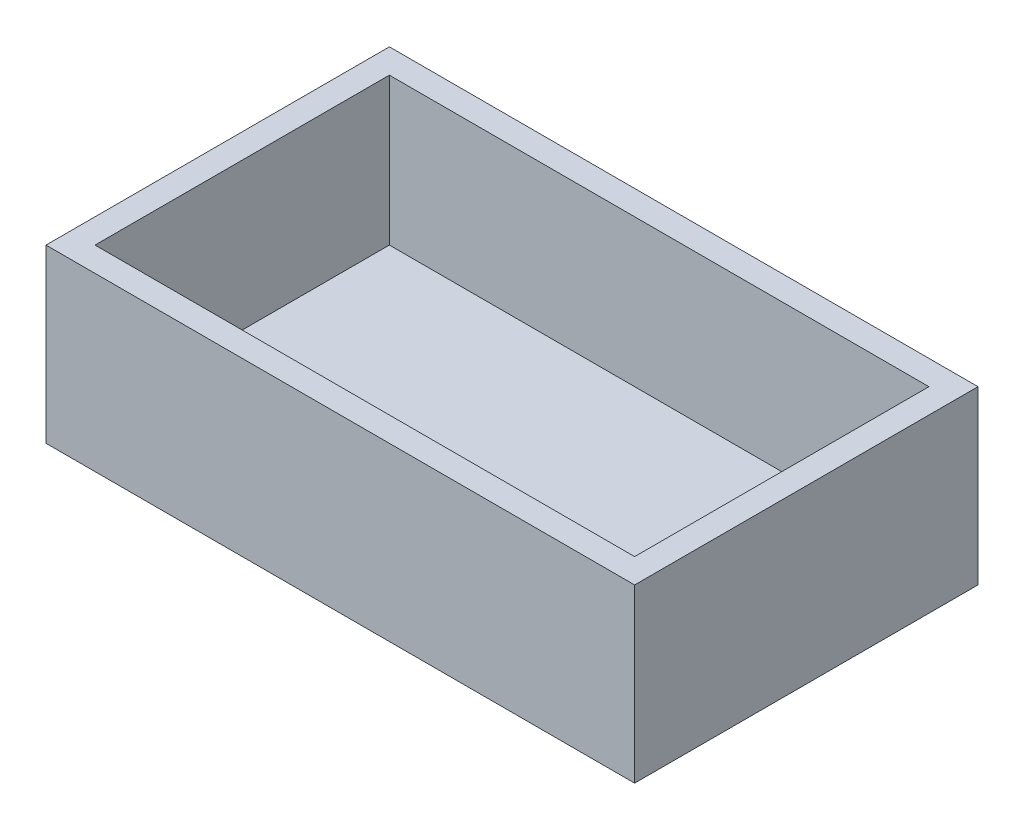
ISO-10303-21;
HEADER;
FILE_DESCRIPTION(('STEP AP214'),'2;1');
FILE_NAME('part.step','',(''),(''),'','','');
FILE_SCHEMA(('AUTOMOTIVE_DESIGN { 1 0 10303 214 1 1 1 1 }'));
ENDSEC;
DATA;
#1=APPLICATION_CONTEXT('core data for automotive mechanical design processes');
#2=APPLICATION_PROTOCOL_DEFINITION('international standard','automotive_design',2000,#1);
#3=PRODUCT_CONTEXT('',#1,'mechanical');
#4=PRODUCT('Part','Part','',(#3));
#5=PRODUCT_RELATED_PRODUCT_CATEGORY('part','',(#4));
#6=PRODUCT_DEFINITION_FORMATION('','',#4);
#7=PRODUCT_DEFINITION_CONTEXT('part definition',#1,'design');
#8=PRODUCT_DEFINITION('design','',#6,#7);
#9=PRODUCT_DEFINITION_SHAPE('','',#8);
#10=(LENGTH_UNIT() NAMED_UNIT(*) SI_UNIT(.MILLI.,.METRE.));
#11=(NAMED_UNIT(*) PLANE_ANGLE_UNIT() SI_UNIT($,.RADIAN.));
#12=(NAMED_UNIT(*) SI_UNIT($,.STERADIAN.) SOLID_ANGLE_UNIT());
#13=UNCERTAINTY_MEASURE_WITH_UNIT(LENGTH_MEASURE(1.E-05),#10,'distance_accuracy_value','');
#14=(GEOMETRIC_REPRESENTATION_CONTEXT(3) GLOBAL_UNCERTAINTY_ASSIGNED_CONTEXT((#13)) GLOBAL_UNIT_ASSIGNED_CONTEXT((#10,
#11,#12)) REPRESENTATION_CONTEXT('',''));
#15=CARTESIAN_POINT('',(0.,0.,0.));
#16=DIRECTION('',(0.,0.,1.));
#17=DIRECTION('',(1.,0.,0.));
#18=AXIS2_PLACEMENT_3D('',#15,#16,#17);
#19=CARTESIAN_POINT('',(0.,44.45,0.));
#20=DIRECTION('',(1.,0.,0.));
#21=DIRECTION('',(0.,0.,-1.));
#22=AXIS2_PLACEMENT_3D('',#19,#20,#21);
#23=PLANE('',#22);
#24=DIRECTION('',(0.,0.,1.));
#25=VECTOR('',#24,1.);
#26=CARTESIAN_POINT('',(0.,0.,0.));
#27=LINE('',#26,#25);
#28=CARTESIAN_POINT('',(0.,0.,-88.9));
#29=VERTEX_POINT('',#28);
#30=CARTESIAN_POINT('',(0.,0.,0.));
#31=VERTEX_POINT('',#30);
#32=EDGE_CURVE('E162',#29,#31,#27,.T.);
#33=ORIENTED_EDGE('',*,*,#32,.T.);
#34=DIRECTION('',(0.,-1.,0.));
#35=VECTOR('',#34,1.);
#36=CARTESIAN_POINT('',(0.,44.45,0.));
#37=LINE('',#36,#35);
#38=CARTESIAN_POINT('',(0.,44.45,0.));
#39=VERTEX_POINT('',#38);
#40=EDGE_CURVE('E11',#39,#31,#37,.T.);
#41=ORIENTED_EDGE('',*,*,#40,.F.);
#42=DIRECTION('',(0.,0.,1.));
#43=VECTOR('',#42,1.);
#44=CARTESIAN_POINT('',(0.,44.45,0.));
#45=LINE('',#44,#43);
#46=CARTESIAN_POINT('',(0.,44.45,-88.9));
#47=VERTEX_POINT('',#46);
#48=EDGE_CURVE('E168',#47,#39,#45,.T.);
#49=ORIENTED_EDGE('',*,*,#48,.F.);
#50=DIRECTION('',(0.,-1.,0.));
#51=VECTOR('',#50,1.);
#52=CARTESIAN_POINT('',(0.,44.45,-88.9));
#53=LINE('',#52,#51);
#54=EDGE_CURVE('E178',#47,#29,#53,.T.);
#55=ORIENTED_EDGE('',*,*,#54,.T.);
#56=EDGE_LOOP('',(#33,#41,#49,#55));
#57=FACE_BOUND('',#56,.T.);
#58=ADVANCED_FACE('F43',(#57),#23,.F.);
#59=CARTESIAN_POINT('',(0.,44.45,0.));
#60=DIRECTION('',(0.,0.,-1.));
#61=DIRECTION('',(-1.,0.,0.));
#62=AXIS2_PLACEMENT_3D('',#59,#60,#61);
#63=PLANE('',#62);
#64=DIRECTION('',(1.,0.,0.));
#65=VECTOR('',#64,1.);
#66=CARTESIAN_POINT('',(0.,0.,0.));
#67=LINE('',#66,#65);
#68=CARTESIAN_POINT('',(152.4,0.,0.));
#69=VERTEX_POINT('',#68);
#70=EDGE_CURVE('E182',#31,#69,#67,.T.);
#71=ORIENTED_EDGE('',*,*,#70,.T.);
#72=DIRECTION('',(0.,-1.,0.));
#73=VECTOR('',#72,1.);
#74=CARTESIAN_POINT('',(152.4,44.45,0.));
#75=LINE('',#74,#73);
#76=CARTESIAN_POINT('',(152.4,44.45,0.));
#77=VERTEX_POINT('',#76);
#78=EDGE_CURVE('E51',#77,#69,#75,.T.);
#79=ORIENTED_EDGE('',*,*,#78,.F.);
#80=DIRECTION('',(1.,0.,0.));
#81=VECTOR('',#80,1.);
#82=CARTESIAN_POINT('',(0.,44.45,0.));
#83=LINE('',#82,#81);
#84=EDGE_CURVE('E95',#39,#77,#83,.T.);
#85=ORIENTED_EDGE('',*,*,#84,.F.);
#86=ORIENTED_EDGE('',*,*,#40,.T.);
#87=EDGE_LOOP('',(#71,#79,#85,#86));
#88=FACE_BOUND('',#87,.T.);
#89=ADVANCED_FACE('F217',(#88),#63,.F.);
#90=CARTESIAN_POINT('',(152.4,44.45,0.));
#91=DIRECTION('',(-1.,0.,0.));
#92=DIRECTION('',(0.,0.,1.));
#93=AXIS2_PLACEMENT_3D('',#90,#91,#92);
#94=PLANE('',#93);
#95=DIRECTION('',(0.,0.,-1.));
#96=VECTOR('',#95,1.);
#97=CARTESIAN_POINT('',(152.4,0.,0.));
#98=LINE('',#97,#96);
#99=CARTESIAN_POINT('',(152.4,0.,-88.9));
#100=VERTEX_POINT('',#99);
#101=EDGE_CURVE('E185',#69,#100,#98,.T.);
#102=ORIENTED_EDGE('',*,*,#101,.T.);
#103=DIRECTION('',(0.,-1.,0.));
#104=VECTOR('',#103,1.);
#105=CARTESIAN_POINT('',(152.4,44.45,-88.9));
#106=LINE('',#105,#104);
#107=CARTESIAN_POINT('',(152.4,44.45,-88.9));
#108=VERTEX_POINT('',#107);
#109=EDGE_CURVE('E192',#108,#100,#106,.T.);
#110=ORIENTED_EDGE('',*,*,#109,.F.);
#111=DIRECTION('',(0.,0.,-1.));
#112=VECTOR('',#111,1.);
#113=CARTESIAN_POINT('',(152.4,44.45,0.));
#114=LINE('',#113,#112);
#115=EDGE_CURVE('E173',#77,#108,#114,.T.);
#116=ORIENTED_EDGE('',*,*,#115,.F.);
#117=ORIENTED_EDGE('',*,*,#78,.T.);
#118=EDGE_LOOP('',(#102,#110,#116,#117));
#119=FACE_BOUND('',#118,.T.);
#120=ADVANCED_FACE('F199',(#119),#94,.F.);
#121=CARTESIAN_POINT('',(0.,44.45,-88.9));
#122=DIRECTION('',(0.,0.,1.));
#123=DIRECTION('',(1.,0.,0.));
#124=AXIS2_PLACEMENT_3D('',#121,#122,#123);
#125=PLANE('',#124);
#126=DIRECTION('',(-1.,0.,0.));
#127=VECTOR('',#126,1.);
#128=CARTESIAN_POINT('',(0.,0.,-88.9));
#129=LINE('',#128,#127);
#130=EDGE_CURVE('E88',#100,#29,#129,.T.);
#131=ORIENTED_EDGE('',*,*,#130,.T.);
#132=ORIENTED_EDGE('',*,*,#54,.F.);
#133=DIRECTION('',(-1.,0.,0.));
#134=VECTOR('',#133,1.);
#135=CARTESIAN_POINT('',(0.,44.45,-88.9));
#136=LINE('',#135,#134);
#137=EDGE_CURVE('E67',#108,#47,#136,.T.);
#138=ORIENTED_EDGE('',*,*,#137,.F.);
#139=ORIENTED_EDGE('',*,*,#109,.T.);
#140=EDGE_LOOP('',(#131,#132,#138,#139));
#141=FACE_BOUND('',#140,.T.);
#142=ADVANCED_FACE('F207',(#141),#125,.F.);
#143=CARTESIAN_POINT('',(0.,44.45,0.));
#144=DIRECTION('',(0.,-1.,0.));
#145=DIRECTION('',(0.,0.,-1.));
#146=AXIS2_PLACEMENT_3D('',#143,#144,#145);
#147=PLANE('',#146);
#148=DIRECTION('',(1.,0.,0.));
#149=VECTOR('',#148,1.);
#150=CARTESIAN_POINT('',(6.34999999999999,44.45,-6.35));
#151=LINE('',#150,#149);
#152=CARTESIAN_POINT('',(6.34999999999999,44.45,-6.35));
#153=VERTEX_POINT('',#152);
#154=CARTESIAN_POINT('',(146.05,44.45,-6.35));
#155=VERTEX_POINT('',#154);
#156=EDGE_CURVE('E153',#153,#155,#151,.T.);
#157=ORIENTED_EDGE('',*,*,#156,.F.);
#158=DIRECTION('',(0.,0.,1.));
#159=VECTOR('',#158,1.);
#160=CARTESIAN_POINT('',(6.34999999999999,44.45,-6.35));
#161=LINE('',#160,#159);
#162=CARTESIAN_POINT('',(6.34999999999998,44.45,-82.55));
#163=VERTEX_POINT('',#162);
#164=EDGE_CURVE('E58',#163,#153,#161,.T.);
#165=ORIENTED_EDGE('',*,*,#164,.F.);
#166=DIRECTION('',(-1.,0.,0.));
#167=VECTOR('',#166,1.);
#168=CARTESIAN_POINT('',(6.34999999999998,44.45,-82.55));
#169=LINE('',#168,#167);
#170=CARTESIAN_POINT('',(146.05,44.45,-82.55));
#171=VERTEX_POINT('',#170);
#172=EDGE_CURVE('E140',#171,#163,#169,.T.);
#173=ORIENTED_EDGE('',*,*,#172,.F.);
#174=DIRECTION('',(0.,0.,-1.));
#175=VECTOR('',#174,1.);
#176=CARTESIAN_POINT('',(146.05,44.45,-6.35));
#177=LINE('',#176,#175);
#178=EDGE_CURVE('E144',#155,#171,#177,.T.);
#179=ORIENTED_EDGE('',*,*,#178,.F.);
#180=EDGE_LOOP('',(#157,#165,#173,#179));
#181=FACE_BOUND('',#180,.T.);
#182=ORIENTED_EDGE('',*,*,#48,.T.);
#183=ORIENTED_EDGE('',*,*,#84,.T.);
#184=ORIENTED_EDGE('',*,*,#115,.T.);
#185=ORIENTED_EDGE('',*,*,#137,.T.);
#186=EDGE_LOOP('',(#182,#183,#184,#185));
#187=FACE_BOUND('',#186,.T.);
#188=ADVANCED_FACE('F209',(#181,#187),#147,.F.);
#189=CARTESIAN_POINT('',(0.,0.,0.));
#190=DIRECTION('',(0.,-1.,0.));
#191=DIRECTION('',(0.,0.,-1.));
#192=AXIS2_PLACEMENT_3D('',#189,#190,#191);
#193=PLANE('',#192);
#194=ORIENTED_EDGE('',*,*,#32,.F.);
#195=ORIENTED_EDGE('',*,*,#130,.F.);
#196=ORIENTED_EDGE('',*,*,#101,.F.);
#197=ORIENTED_EDGE('',*,*,#70,.F.);
#198=EDGE_LOOP('',(#194,#195,#196,#197));
#199=FACE_BOUND('',#198,.T.);
#200=ADVANCED_FACE('F203',(#199),#193,.T.);
#201=CARTESIAN_POINT('',(6.34999999999999,6.34999999999999,-6.35));
#202=DIRECTION('',(-1.,0.,0.));
#203=DIRECTION('',(0.,0.,1.));
#204=AXIS2_PLACEMENT_3D('',#201,#202,#203);
#205=PLANE('',#204);
#206=ORIENTED_EDGE('',*,*,#164,.T.);
#207=DIRECTION('',(0.,1.,0.));
#208=VECTOR('',#207,1.);
#209=CARTESIAN_POINT('',(6.34999999999999,6.34999999999999,-6.35));
#210=LINE('',#209,#208);
#211=CARTESIAN_POINT('',(6.34999999999999,6.34999999999999,-6.35));
#212=VERTEX_POINT('',#211);
#213=EDGE_CURVE('E115',#212,#153,#210,.T.);
#214=ORIENTED_EDGE('',*,*,#213,.F.);
#215=DIRECTION('',(0.,0.,1.));
#216=VECTOR('',#215,1.);
#217=CARTESIAN_POINT('',(6.34999999999999,6.34999999999999,-6.35));
#218=LINE('',#217,#216);
#219=CARTESIAN_POINT('',(6.34999999999998,6.34999999999999,-82.55));
#220=VERTEX_POINT('',#219);
#221=EDGE_CURVE('E119',#220,#212,#218,.T.);
#222=ORIENTED_EDGE('',*,*,#221,.F.);
#223=DIRECTION('',(0.,1.,0.));
#224=VECTOR('',#223,1.);
#225=CARTESIAN_POINT('',(6.34999999999998,6.34999999999999,-82.55));
#226=LINE('',#225,#224);
#227=EDGE_CURVE('E159',#220,#163,#226,.T.);
#228=ORIENTED_EDGE('',*,*,#227,.T.);
#229=EDGE_LOOP('',(#206,#214,#222,#228));
#230=FACE_BOUND('',#229,.T.);
#231=ADVANCED_FACE('F117',(#230),#205,.F.);
#232=CARTESIAN_POINT('',(6.34999999999998,6.34999999999999,-82.55));
#233=DIRECTION('',(0.,0.,-1.));
#234=DIRECTION('',(-1.,0.,0.));
#235=AXIS2_PLACEMENT_3D('',#232,#233,#234);
#236=PLANE('',#235);
#237=ORIENTED_EDGE('',*,*,#172,.T.);
#238=ORIENTED_EDGE('',*,*,#227,.F.);
#239=DIRECTION('',(-1.,0.,0.));
#240=VECTOR('',#239,1.);
#241=CARTESIAN_POINT('',(6.34999999999998,6.34999999999999,-82.55));
#242=LINE('',#241,#240);
#243=CARTESIAN_POINT('',(146.05,6.34999999999999,-82.55));
#244=VERTEX_POINT('',#243);
#245=EDGE_CURVE('E126',#244,#220,#242,.T.);
#246=ORIENTED_EDGE('',*,*,#245,.F.);
#247=DIRECTION('',(0.,1.,0.));
#248=VECTOR('',#247,1.);
#249=CARTESIAN_POINT('',(146.05,6.34999999999999,-82.55));
#250=LINE('',#249,#248);
#251=EDGE_CURVE('E163',#244,#171,#250,.T.);
#252=ORIENTED_EDGE('',*,*,#251,.T.);
#253=EDGE_LOOP('',(#237,#238,#246,#252));
#254=FACE_BOUND('',#253,.T.);
#255=ADVANCED_FACE('F260',(#254),#236,.F.);
#256=CARTESIAN_POINT('',(146.05,6.34999999999999,-6.35));
#257=DIRECTION('',(1.,0.,0.));
#258=DIRECTION('',(0.,0.,-1.));
#259=AXIS2_PLACEMENT_3D('',#256,#257,#258);
#260=PLANE('',#259);
#261=ORIENTED_EDGE('',*,*,#178,.T.);
#262=ORIENTED_EDGE('',*,*,#251,.F.);
#263=DIRECTION('',(0.,0.,-1.));
#264=VECTOR('',#263,1.);
#265=CARTESIAN_POINT('',(146.05,6.34999999999999,-6.35));
#266=LINE('',#265,#264);
#267=CARTESIAN_POINT('',(146.05,6.34999999999999,-6.35));
#268=VERTEX_POINT('',#267);
#269=EDGE_CURVE('E135',#268,#244,#266,.T.);
#270=ORIENTED_EDGE('',*,*,#269,.F.);
#271=DIRECTION('',(0.,1.,0.));
#272=VECTOR('',#271,1.);
#273=CARTESIAN_POINT('',(146.05,6.34999999999999,-6.35));
#274=LINE('',#273,#272);
#275=EDGE_CURVE('E125',#268,#155,#274,.T.);
#276=ORIENTED_EDGE('',*,*,#275,.T.);
#277=EDGE_LOOP('',(#261,#262,#270,#276));
#278=FACE_BOUND('',#277,.T.);
#279=ADVANCED_FACE('F270',(#278),#260,.F.);
#280=CARTESIAN_POINT('',(6.34999999999999,6.34999999999999,-6.35));
#281=DIRECTION('',(0.,0.,1.));
#282=DIRECTION('',(1.,0.,0.));
#283=AXIS2_PLACEMENT_3D('',#280,#281,#282);
#284=PLANE('',#283);
#285=ORIENTED_EDGE('',*,*,#156,.T.);
#286=ORIENTED_EDGE('',*,*,#275,.F.);
#287=DIRECTION('',(1.,0.,0.));
#288=VECTOR('',#287,1.);
#289=CARTESIAN_POINT('',(6.34999999999999,6.34999999999999,-6.35));
#290=LINE('',#289,#288);
#291=EDGE_CURVE('E129',#212,#268,#290,.T.);
#292=ORIENTED_EDGE('',*,*,#291,.F.);
#293=ORIENTED_EDGE('',*,*,#213,.T.);
#294=EDGE_LOOP('',(#285,#286,#292,#293));
#295=FACE_BOUND('',#294,.T.);
#296=ADVANCED_FACE('F130',(#295),#284,.F.);
#297=CARTESIAN_POINT('',(0.,6.34999999999999,0.));
#298=DIRECTION('',(0.,-1.,0.));
#299=DIRECTION('',(0.,0.,-1.));
#300=AXIS2_PLACEMENT_3D('',#297,#298,#299);
#301=PLANE('',#300);
#302=ORIENTED_EDGE('',*,*,#221,.T.);
#303=ORIENTED_EDGE('',*,*,#291,.T.);
#304=ORIENTED_EDGE('',*,*,#269,.T.);
#305=ORIENTED_EDGE('',*,*,#245,.T.);
#306=EDGE_LOOP('',(#302,#303,#304,#305));
#307=FACE_BOUND('',#306,.T.);
#308=ADVANCED_FACE('F137',(#307),#301,.F.);
#309=CLOSED_SHELL('',(#58,#89,#120,#142,#188,#200,#231,#255,#279,#296,#308));
#310=MANIFOLD_SOLID_BREP('B2',#309);
#311=ADVANCED_BREP_SHAPE_REPRESENTATION('',(#18,#310),#14);
#312=SHAPE_DEFINITION_REPRESENTATION(#9,#311);
ENDSEC;
END-ISO-10303-21;
